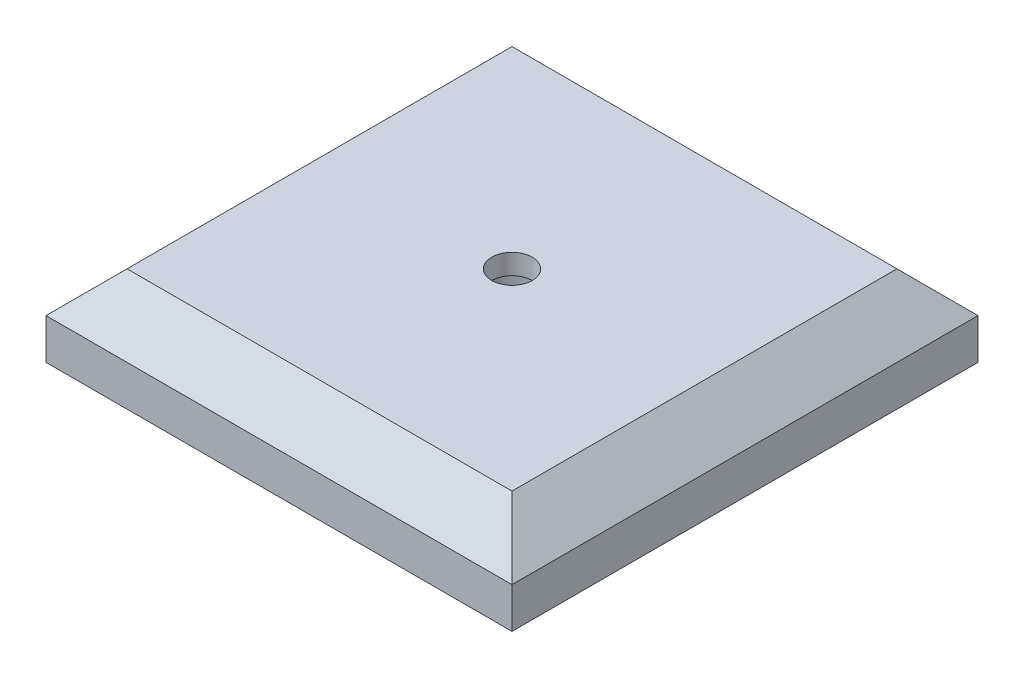
ISO-10303-21;
HEADER;
FILE_DESCRIPTION(('STEP AP214'),'2;1');
FILE_NAME('part.step','',(''),(''),'','','');
FILE_SCHEMA(('AUTOMOTIVE_DESIGN { 1 0 10303 214 1 1 1 1 }'));
ENDSEC;
DATA;
#1=APPLICATION_CONTEXT('core data for automotive mechanical design processes');
#2=APPLICATION_PROTOCOL_DEFINITION('international standard','automotive_design',2000,#1);
#3=PRODUCT_CONTEXT('',#1,'mechanical');
#4=PRODUCT('Part','Part','',(#3));
#5=PRODUCT_RELATED_PRODUCT_CATEGORY('part','',(#4));
#6=PRODUCT_DEFINITION_FORMATION('','',#4);
#7=PRODUCT_DEFINITION_CONTEXT('part definition',#1,'design');
#8=PRODUCT_DEFINITION('design','',#6,#7);
#9=PRODUCT_DEFINITION_SHAPE('','',#8);
#10=(LENGTH_UNIT() NAMED_UNIT(*) SI_UNIT(.MILLI.,.METRE.));
#11=(NAMED_UNIT(*) PLANE_ANGLE_UNIT() SI_UNIT($,.RADIAN.));
#12=(NAMED_UNIT(*) SI_UNIT($,.STERADIAN.) SOLID_ANGLE_UNIT());
#13=UNCERTAINTY_MEASURE_WITH_UNIT(LENGTH_MEASURE(1.E-05),#10,'distance_accuracy_value','');
#14=(GEOMETRIC_REPRESENTATION_CONTEXT(3) GLOBAL_UNCERTAINTY_ASSIGNED_CONTEXT((#13)) GLOBAL_UNIT_ASSIGNED_CONTEXT((#10,
#11,#12)) REPRESENTATION_CONTEXT('',''));
#15=CARTESIAN_POINT('',(0.,0.,0.));
#16=DIRECTION('',(0.,0.,1.));
#17=DIRECTION('',(1.,0.,0.));
#18=AXIS2_PLACEMENT_3D('',#15,#16,#17);
#19=CARTESIAN_POINT('',(36.5125,12.7,36.5125));
#20=DIRECTION('',(-1.,0.,0.));
#21=DIRECTION('',(0.,0.,1.));
#22=AXIS2_PLACEMENT_3D('',#19,#20,#21);
#23=PLANE('',#22);
#24=DIRECTION('',(0.,-1.,0.));
#25=VECTOR('',#24,1.);
#26=CARTESIAN_POINT('',(36.5125,12.7,-36.5125));
#27=LINE('',#26,#25);
#28=CARTESIAN_POINT('',(36.5125,6.34999999999996,-36.5125));
#29=VERTEX_POINT('',#28);
#30=CARTESIAN_POINT('',(36.5125,0.,-36.5125));
#31=VERTEX_POINT('',#30);
#32=EDGE_CURVE('E107',#29,#31,#27,.T.);
#33=ORIENTED_EDGE('',*,*,#32,.F.);
#34=DIRECTION('',(0.,0.,1.));
#35=VECTOR('',#34,1.);
#36=CARTESIAN_POINT('',(36.5125,6.34999999999996,36.5125));
#37=LINE('',#36,#35);
#38=CARTESIAN_POINT('',(36.5125,6.34999999999996,36.5125));
#39=VERTEX_POINT('',#38);
#40=EDGE_CURVE('E169',#29,#39,#37,.T.);
#41=ORIENTED_EDGE('',*,*,#40,.T.);
#42=DIRECTION('',(0.,-1.,0.));
#43=VECTOR('',#42,1.);
#44=CARTESIAN_POINT('',(36.5125,12.7,36.5125));
#45=LINE('',#44,#43);
#46=CARTESIAN_POINT('',(36.5125,0.,36.5125));
#47=VERTEX_POINT('',#46);
#48=EDGE_CURVE('E129',#39,#47,#45,.T.);
#49=ORIENTED_EDGE('',*,*,#48,.T.);
#50=DIRECTION('',(0.,0.,-1.));
#51=VECTOR('',#50,1.);
#52=CARTESIAN_POINT('',(36.5125,0.,36.5125));
#53=LINE('',#52,#51);
#54=EDGE_CURVE('E123',#47,#31,#53,.T.);
#55=ORIENTED_EDGE('',*,*,#54,.T.);
#56=EDGE_LOOP('',(#33,#41,#49,#55));
#57=FACE_BOUND('',#56,.T.);
#58=ADVANCED_FACE('F54',(#57),#23,.F.);
#59=CARTESIAN_POINT('',(-36.5125,12.7,-36.5125));
#60=DIRECTION('',(0.,0.,1.));
#61=DIRECTION('',(1.,0.,0.));
#62=AXIS2_PLACEMENT_3D('',#59,#60,#61);
#63=PLANE('',#62);
#64=DIRECTION('',(0.,-1.,0.));
#65=VECTOR('',#64,1.);
#66=CARTESIAN_POINT('',(-36.5125,12.7,-36.5125));
#67=LINE('',#66,#65);
#68=CARTESIAN_POINT('',(-36.5125,6.34999999999996,-36.5125));
#69=VERTEX_POINT('',#68);
#70=CARTESIAN_POINT('',(-36.5125,0.,-36.5125));
#71=VERTEX_POINT('',#70);
#72=EDGE_CURVE('E117',#69,#71,#67,.T.);
#73=ORIENTED_EDGE('',*,*,#72,.F.);
#74=DIRECTION('',(1.,0.,0.));
#75=VECTOR('',#74,1.);
#76=CARTESIAN_POINT('',(-36.5125,6.34999999999996,-36.5125));
#77=LINE('',#76,#75);
#78=EDGE_CURVE('E65',#69,#29,#77,.T.);
#79=ORIENTED_EDGE('',*,*,#78,.T.);
#80=ORIENTED_EDGE('',*,*,#32,.T.);
#81=DIRECTION('',(-1.,0.,0.));
#82=VECTOR('',#81,1.);
#83=CARTESIAN_POINT('',(-36.5125,0.,-36.5125));
#84=LINE('',#83,#82);
#85=EDGE_CURVE('E110',#31,#71,#84,.T.);
#86=ORIENTED_EDGE('',*,*,#85,.T.);
#87=EDGE_LOOP('',(#73,#79,#80,#86));
#88=FACE_BOUND('',#87,.T.);
#89=ADVANCED_FACE('F109',(#88),#63,.F.);
#90=CARTESIAN_POINT('',(-36.5125,12.7,36.5125));
#91=DIRECTION('',(1.,0.,0.));
#92=DIRECTION('',(0.,0.,-1.));
#93=AXIS2_PLACEMENT_3D('',#90,#91,#92);
#94=PLANE('',#93);
#95=DIRECTION('',(0.,-1.,0.));
#96=VECTOR('',#95,1.);
#97=CARTESIAN_POINT('',(-36.5125,12.7,36.5125));
#98=LINE('',#97,#96);
#99=CARTESIAN_POINT('',(-36.5125,6.34999999999996,36.5125));
#100=VERTEX_POINT('',#99);
#101=CARTESIAN_POINT('',(-36.5125,0.,36.5125));
#102=VERTEX_POINT('',#101);
#103=EDGE_CURVE('E148',#100,#102,#98,.T.);
#104=ORIENTED_EDGE('',*,*,#103,.F.);
#105=DIRECTION('',(0.,0.,-1.));
#106=VECTOR('',#105,1.);
#107=CARTESIAN_POINT('',(-36.5125,6.34999999999996,36.5125));
#108=LINE('',#107,#106);
#109=EDGE_CURVE('E13',#100,#69,#108,.T.);
#110=ORIENTED_EDGE('',*,*,#109,.T.);
#111=ORIENTED_EDGE('',*,*,#72,.T.);
#112=DIRECTION('',(0.,0.,1.));
#113=VECTOR('',#112,1.);
#114=CARTESIAN_POINT('',(-36.5125,0.,36.5125));
#115=LINE('',#114,#113);
#116=EDGE_CURVE('E125',#71,#102,#115,.T.);
#117=ORIENTED_EDGE('',*,*,#116,.T.);
#118=EDGE_LOOP('',(#104,#110,#111,#117));
#119=FACE_BOUND('',#118,.T.);
#120=ADVANCED_FACE('F200',(#119),#94,.F.);
#121=CARTESIAN_POINT('',(-36.5125,12.7,36.5125));
#122=DIRECTION('',(0.,0.,-1.));
#123=DIRECTION('',(-1.,0.,0.));
#124=AXIS2_PLACEMENT_3D('',#121,#122,#123);
#125=PLANE('',#124);
#126=ORIENTED_EDGE('',*,*,#48,.F.);
#127=DIRECTION('',(-1.,0.,0.));
#128=VECTOR('',#127,1.);
#129=CARTESIAN_POINT('',(-36.5125,6.34999999999996,36.5125));
#130=LINE('',#129,#128);
#131=EDGE_CURVE('E165',#39,#100,#130,.T.);
#132=ORIENTED_EDGE('',*,*,#131,.T.);
#133=ORIENTED_EDGE('',*,*,#103,.T.);
#134=DIRECTION('',(1.,0.,0.));
#135=VECTOR('',#134,1.);
#136=CARTESIAN_POINT('',(-36.5125,0.,36.5125));
#137=LINE('',#136,#135);
#138=EDGE_CURVE('E143',#102,#47,#137,.T.);
#139=ORIENTED_EDGE('',*,*,#138,.T.);
#140=EDGE_LOOP('',(#126,#132,#133,#139));
#141=FACE_BOUND('',#140,.T.);
#142=ADVANCED_FACE('F199',(#141),#125,.F.);
#143=CARTESIAN_POINT('',(0.,12.7,0.));
#144=DIRECTION('',(0.,-1.,0.));
#145=DIRECTION('',(0.,0.,-1.));
#146=AXIS2_PLACEMENT_3D('',#143,#144,#145);
#147=PLANE('',#146);
#148=CARTESIAN_POINT('',(0.,12.7,0.));
#149=DIRECTION('',(0.,1.,0.));
#150=DIRECTION('',(0.,0.,1.));
#151=AXIS2_PLACEMENT_3D('',#148,#149,#150);
#152=CIRCLE('',#151,3.175);
#153=CARTESIAN_POINT('',(0.,12.7,3.175));
#154=VERTEX_POINT('',#153);
#155=EDGE_CURVE('E138',#154,#154,#152,.T.);
#156=ORIENTED_EDGE('',*,*,#155,.F.);
#157=EDGE_LOOP('',(#156));
#158=FACE_BOUND('',#157,.T.);
#159=DIRECTION('',(0.,0.,1.));
#160=VECTOR('',#159,1.);
#161=CARTESIAN_POINT('',(-30.1624999999999,12.7,0.));
#162=LINE('',#161,#160);
#163=CARTESIAN_POINT('',(-30.1624999999999,12.7,-30.1624999999999));
#164=VERTEX_POINT('',#163);
#165=CARTESIAN_POINT('',(-30.1624999999999,12.7,30.1625));
#166=VERTEX_POINT('',#165);
#167=EDGE_CURVE('E116',#164,#166,#162,.T.);
#168=ORIENTED_EDGE('',*,*,#167,.T.);
#169=DIRECTION('',(1.,0.,0.));
#170=VECTOR('',#169,1.);
#171=CARTESIAN_POINT('',(0.,12.7,30.1625));
#172=LINE('',#171,#170);
#173=CARTESIAN_POINT('',(30.1625,12.7,30.1625));
#174=VERTEX_POINT('',#173);
#175=EDGE_CURVE('E161',#166,#174,#172,.T.);
#176=ORIENTED_EDGE('',*,*,#175,.T.);
#177=DIRECTION('',(0.,0.,-1.));
#178=VECTOR('',#177,1.);
#179=CARTESIAN_POINT('',(30.1625,12.7,0.));
#180=LINE('',#179,#178);
#181=CARTESIAN_POINT('',(30.1625,12.7,-30.1624999999999));
#182=VERTEX_POINT('',#181);
#183=EDGE_CURVE('E158',#174,#182,#180,.T.);
#184=ORIENTED_EDGE('',*,*,#183,.T.);
#185=DIRECTION('',(-1.,0.,0.));
#186=VECTOR('',#185,1.);
#187=CARTESIAN_POINT('',(0.,12.7,-30.1624999999999));
#188=LINE('',#187,#186);
#189=EDGE_CURVE('E155',#182,#164,#188,.T.);
#190=ORIENTED_EDGE('',*,*,#189,.T.);
#191=EDGE_LOOP('',(#168,#176,#184,#190));
#192=FACE_BOUND('',#191,.T.);
#193=ADVANCED_FACE('F192',(#158,#192),#147,.F.);
#194=CARTESIAN_POINT('',(0.,0.,0.));
#195=DIRECTION('',(0.,-1.,0.));
#196=DIRECTION('',(0.,0.,-1.));
#197=AXIS2_PLACEMENT_3D('',#194,#195,#196);
#198=PLANE('',#197);
#199=CARTESIAN_POINT('',(0.,0.,0.));
#200=DIRECTION('',(0.,-1.,0.));
#201=DIRECTION('',(0.,0.,-1.));
#202=AXIS2_PLACEMENT_3D('',#199,#200,#201);
#203=CIRCLE('',#202,6.35);
#204=CARTESIAN_POINT('',(0.,0.,-6.35));
#205=VERTEX_POINT('',#204);
#206=EDGE_CURVE('E266',#205,#205,#203,.F.);
#207=ORIENTED_EDGE('',*,*,#206,.T.);
#208=EDGE_LOOP('',(#207));
#209=FACE_BOUND('',#208,.T.);
#210=ORIENTED_EDGE('',*,*,#54,.F.);
#211=ORIENTED_EDGE('',*,*,#138,.F.);
#212=ORIENTED_EDGE('',*,*,#116,.F.);
#213=ORIENTED_EDGE('',*,*,#85,.F.);
#214=EDGE_LOOP('',(#210,#211,#212,#213));
#215=FACE_BOUND('',#214,.T.);
#216=ADVANCED_FACE('F121',(#209,#215),#198,.T.);
#217=CARTESIAN_POINT('',(0.,12.7,-30.1624999999999));
#218=DIRECTION('',(0.,-0.707106781186548,0.707106781186547));
#219=DIRECTION('',(-1.,0.,0.));
#220=AXIS2_PLACEMENT_3D('',#217,#218,#219);
#221=PLANE('',#220);
#222=DIRECTION('',(0.577350269189626,-0.577350269189625,-0.577350269189626));
#223=VECTOR('',#222,1.);
#224=CARTESIAN_POINT('',(20.1083333333333,22.7541666666666,-20.1083333333333));
#225=LINE('',#224,#223);
#226=EDGE_CURVE('E136',#29,#182,#225,.F.);
#227=ORIENTED_EDGE('',*,*,#226,.F.);
#228=ORIENTED_EDGE('',*,*,#78,.F.);
#229=DIRECTION('',(-0.577350269189626,-0.577350269189625,-0.577350269189626));
#230=VECTOR('',#229,1.);
#231=CARTESIAN_POINT('',(-20.1083333333333,22.7541666666666,-20.1083333333333));
#232=LINE('',#231,#230);
#233=EDGE_CURVE('E59',#164,#69,#232,.T.);
#234=ORIENTED_EDGE('',*,*,#233,.F.);
#235=ORIENTED_EDGE('',*,*,#189,.F.);
#236=EDGE_LOOP('',(#227,#228,#234,#235));
#237=FACE_BOUND('',#236,.T.);
#238=ADVANCED_FACE('F57',(#237),#221,.F.);
#239=CARTESIAN_POINT('',(-30.1624999999999,12.7,0.));
#240=DIRECTION('',(0.707106781186547,-0.707106781186548,0.));
#241=DIRECTION('',(0.,0.,1.));
#242=AXIS2_PLACEMENT_3D('',#239,#240,#241);
#243=PLANE('',#242);
#244=ORIENTED_EDGE('',*,*,#233,.T.);
#245=ORIENTED_EDGE('',*,*,#109,.F.);
#246=DIRECTION('',(0.577350269189626,0.577350269189625,-0.577350269189626));
#247=VECTOR('',#246,1.);
#248=CARTESIAN_POINT('',(-20.1083333333333,22.7541666666666,20.1083333333333));
#249=LINE('',#248,#247);
#250=EDGE_CURVE('E177',#166,#100,#249,.F.);
#251=ORIENTED_EDGE('',*,*,#250,.F.);
#252=ORIENTED_EDGE('',*,*,#167,.F.);
#253=EDGE_LOOP('',(#244,#245,#251,#252));
#254=FACE_BOUND('',#253,.T.);
#255=ADVANCED_FACE('F225',(#254),#243,.F.);
#256=CARTESIAN_POINT('',(30.1625,12.7,0.));
#257=DIRECTION('',(-0.707106781186547,-0.707106781186548,0.));
#258=DIRECTION('',(0.,0.,-1.));
#259=AXIS2_PLACEMENT_3D('',#256,#257,#258);
#260=PLANE('',#259);
#261=ORIENTED_EDGE('',*,*,#226,.T.);
#262=ORIENTED_EDGE('',*,*,#183,.F.);
#263=DIRECTION('',(0.577350269189626,-0.577350269189625,0.577350269189626));
#264=VECTOR('',#263,1.);
#265=CARTESIAN_POINT('',(20.1083333333333,22.7541666666666,20.1083333333333));
#266=LINE('',#265,#264);
#267=EDGE_CURVE('E174',#39,#174,#266,.F.);
#268=ORIENTED_EDGE('',*,*,#267,.F.);
#269=ORIENTED_EDGE('',*,*,#40,.F.);
#270=EDGE_LOOP('',(#261,#262,#268,#269));
#271=FACE_BOUND('',#270,.T.);
#272=ADVANCED_FACE('F185',(#271),#260,.F.);
#273=CARTESIAN_POINT('',(0.,12.7,30.1625));
#274=DIRECTION('',(0.,-0.707106781186548,-0.707106781186547));
#275=DIRECTION('',(1.,0.,0.));
#276=AXIS2_PLACEMENT_3D('',#273,#274,#275);
#277=PLANE('',#276);
#278=ORIENTED_EDGE('',*,*,#250,.T.);
#279=ORIENTED_EDGE('',*,*,#131,.F.);
#280=ORIENTED_EDGE('',*,*,#267,.T.);
#281=ORIENTED_EDGE('',*,*,#175,.F.);
#282=EDGE_LOOP('',(#278,#279,#280,#281));
#283=FACE_BOUND('',#282,.T.);
#284=ADVANCED_FACE('F196',(#283),#277,.F.);
#285=CARTESIAN_POINT('',(0.,9.525,0.));
#286=DIRECTION('',(0.,1.,0.));
#287=DIRECTION('',(0.,0.,1.));
#288=AXIS2_PLACEMENT_3D('',#285,#286,#287);
#289=CYLINDRICAL_SURFACE('',#288,3.175);
#290=CARTESIAN_POINT('',(0.,9.525,0.));
#291=DIRECTION('',(0.,1.,0.));
#292=DIRECTION('',(0.,0.,1.));
#293=AXIS2_PLACEMENT_3D('',#290,#291,#292);
#294=CIRCLE('',#293,3.175);
#295=CARTESIAN_POINT('',(0.,9.525,3.175));
#296=VERTEX_POINT('',#295);
#297=EDGE_CURVE('E260',#296,#296,#294,.T.);
#298=ORIENTED_EDGE('',*,*,#297,.F.);
#299=EDGE_LOOP('',(#298));
#300=FACE_BOUND('',#299,.T.);
#301=ORIENTED_EDGE('',*,*,#155,.T.);
#302=EDGE_LOOP('',(#301));
#303=FACE_BOUND('',#302,.T.);
#304=ADVANCED_FACE('F220',(#300,#303),#289,.F.);
#305=CARTESIAN_POINT('',(0.,-0.001000000000001,0.));
#306=DIRECTION('',(0.,1.,0.));
#307=DIRECTION('',(0.,0.,1.));
#308=AXIS2_PLACEMENT_3D('',#305,#306,#307);
#309=CYLINDRICAL_SURFACE('',#308,6.35);
#310=ORIENTED_EDGE('',*,*,#206,.F.);
#311=EDGE_LOOP('',(#310));
#312=FACE_BOUND('',#311,.T.);
#313=CARTESIAN_POINT('',(0.,9.525,0.));
#314=DIRECTION('',(0.,1.,0.));
#315=DIRECTION('',(0.,0.,1.));
#316=AXIS2_PLACEMENT_3D('',#313,#314,#315);
#317=CIRCLE('',#316,6.35);
#318=CARTESIAN_POINT('',(0.,9.525,6.35));
#319=VERTEX_POINT('',#318);
#320=EDGE_CURVE('E263',#319,#319,#317,.T.);
#321=ORIENTED_EDGE('',*,*,#320,.T.);
#322=EDGE_LOOP('',(#321));
#323=FACE_BOUND('',#322,.T.);
#324=ADVANCED_FACE('F247',(#312,#323),#309,.F.);
#325=CARTESIAN_POINT('',(0.,9.525,0.));
#326=DIRECTION('',(0.,1.,0.));
#327=DIRECTION('',(0.,0.,1.));
#328=AXIS2_PLACEMENT_3D('',#325,#326,#327);
#329=PLANE('',#328);
#330=ORIENTED_EDGE('',*,*,#297,.T.);
#331=EDGE_LOOP('',(#330));
#332=FACE_BOUND('',#331,.T.);
#333=ORIENTED_EDGE('',*,*,#320,.F.);
#334=EDGE_LOOP('',(#333));
#335=FACE_BOUND('',#334,.T.);
#336=ADVANCED_FACE('F251',(#332,#335),#329,.F.);
#337=CLOSED_SHELL('',(#58,#89,#120,#142,#193,#216,#238,#255,#272,#284,#304,#324,#336));
#338=MANIFOLD_SOLID_BREP('B2',#337);
#339=ADVANCED_BREP_SHAPE_REPRESENTATION('',(#18,#338),#14);
#340=SHAPE_DEFINITION_REPRESENTATION(#9,#339);
ENDSEC;
END-ISO-10303-21;
